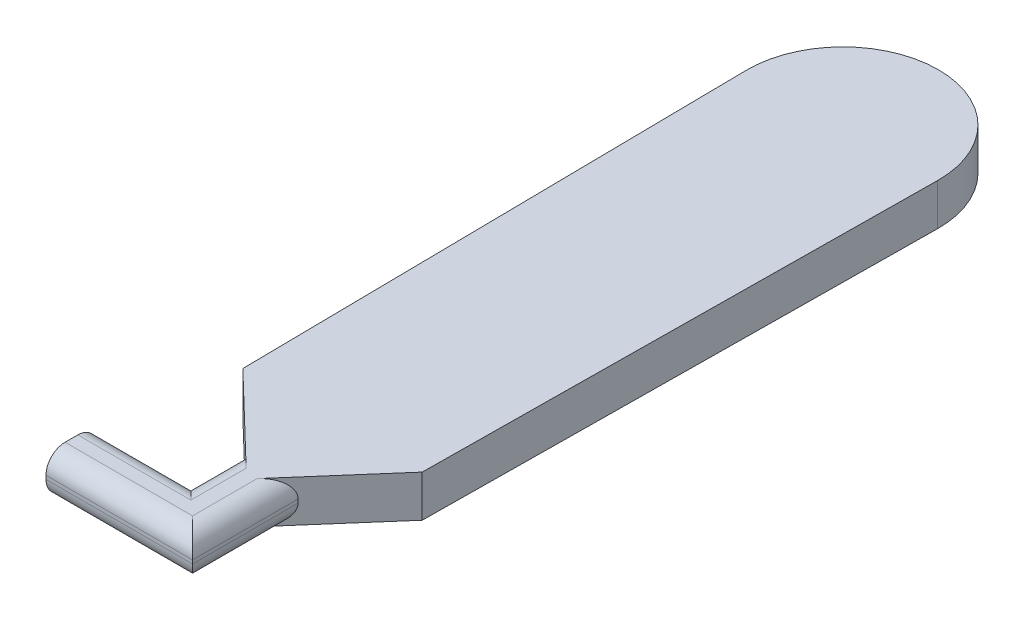
ISO-10303-21;
HEADER;
FILE_DESCRIPTION(('STEP AP214'),'2;1');
FILE_NAME('part.step','',(''),(''),'','','');
FILE_SCHEMA(('AUTOMOTIVE_DESIGN { 1 0 10303 214 1 1 1 1 }'));
ENDSEC;
DATA;
#1=APPLICATION_CONTEXT('core data for automotive mechanical design processes');
#2=APPLICATION_PROTOCOL_DEFINITION('international standard','automotive_design',2000,#1);
#3=PRODUCT_CONTEXT('',#1,'mechanical');
#4=PRODUCT('Part','Part','',(#3));
#5=PRODUCT_RELATED_PRODUCT_CATEGORY('part','',(#4));
#6=PRODUCT_DEFINITION_FORMATION('','',#4);
#7=PRODUCT_DEFINITION_CONTEXT('part definition',#1,'design');
#8=PRODUCT_DEFINITION('design','',#6,#7);
#9=PRODUCT_DEFINITION_SHAPE('','',#8);
#10=(LENGTH_UNIT() NAMED_UNIT(*) SI_UNIT(.MILLI.,.METRE.));
#11=(NAMED_UNIT(*) PLANE_ANGLE_UNIT() SI_UNIT($,.RADIAN.));
#12=(NAMED_UNIT(*) SI_UNIT($,.STERADIAN.) SOLID_ANGLE_UNIT());
#13=UNCERTAINTY_MEASURE_WITH_UNIT(LENGTH_MEASURE(1.E-05),#10,'distance_accuracy_value','');
#14=(GEOMETRIC_REPRESENTATION_CONTEXT(3) GLOBAL_UNCERTAINTY_ASSIGNED_CONTEXT((#13)) GLOBAL_UNIT_ASSIGNED_CONTEXT((#10,
#11,#12)) REPRESENTATION_CONTEXT('',''));
#15=CARTESIAN_POINT('',(0.,0.,0.));
#16=DIRECTION('',(0.,0.,1.));
#17=DIRECTION('',(1.,0.,0.));
#18=AXIS2_PLACEMENT_3D('',#15,#16,#17);
#19=CARTESIAN_POINT('',(8.67320172340913,10.,-0.111731628823776));
#20=DIRECTION('',(-0.999917032248953,0.,0.0128813282873694));
#21=DIRECTION('',(0.0128813282873694,0.,0.999917032248953));
#22=AXIS2_PLACEMENT_3D('',#19,#20,#21);
#23=PLANE('',#22);
#24=DIRECTION('',(-0.0128813282873694,0.,-0.999917032248953));
#25=VECTOR('',#24,1.);
#26=CARTESIAN_POINT('',(8.67320172340913,0.,-0.111731628823776));
#27=LINE('',#26,#25);
#28=CARTESIAN_POINT('',(7.67302590939626,0.,-77.7506838675886));
#29=VERTEX_POINT('',#28);
#30=CARTESIAN_POINT('',(6.09883614107377,0.,-199.947644167181));
#31=VERTEX_POINT('',#30);
#32=EDGE_CURVE('E159',#29,#31,#27,.T.);
#33=ORIENTED_EDGE('',*,*,#32,.F.);
#34=DIRECTION('',(0.,-1.,0.));
#35=VECTOR('',#34,1.);
#36=CARTESIAN_POINT('',(7.67302590939626,10.,-77.7506838675886));
#37=LINE('',#36,#35);
#38=CARTESIAN_POINT('',(7.67302590939626,10.,-77.7506838675886));
#39=VERTEX_POINT('',#38);
#40=EDGE_CURVE('E154',#39,#29,#37,.T.);
#41=ORIENTED_EDGE('',*,*,#40,.F.);
#42=DIRECTION('',(-0.0128813282873694,0.,-0.999917032248953));
#43=VECTOR('',#42,1.);
#44=CARTESIAN_POINT('',(8.67320172340913,10.,-0.111731628823776));
#45=LINE('',#44,#43);
#46=CARTESIAN_POINT('',(6.09883614107377,10.,-199.947644167181));
#47=VERTEX_POINT('',#46);
#48=EDGE_CURVE('E157',#39,#47,#45,.T.);
#49=ORIENTED_EDGE('',*,*,#48,.T.);
#50=DIRECTION('',(0.,-1.,0.));
#51=VECTOR('',#50,1.);
#52=CARTESIAN_POINT('',(6.09883614107377,10.,-199.947644167181));
#53=LINE('',#52,#51);
#54=EDGE_CURVE('E191',#47,#31,#53,.T.);
#55=ORIENTED_EDGE('',*,*,#54,.T.);
#56=EDGE_LOOP('',(#33,#41,#49,#55));
#57=FACE_BOUND('',#56,.T.);
#58=ADVANCED_FACE('F39',(#57),#23,.T.);
#59=CARTESIAN_POINT('',(42.5354193090019,10.,-44.2050407153228));
#60=DIRECTION('',(0.693367619628063,0.,-0.720584029833658));
#61=DIRECTION('',(-0.720584029833658,0.,-0.693367619628063));
#62=AXIS2_PLACEMENT_3D('',#59,#60,#61);
#63=PLANE('',#62);
#64=DIRECTION('',(0.720584029833658,0.,0.693367619628063));
#65=VECTOR('',#64,1.);
#66=CARTESIAN_POINT('',(42.5354193090019,0.,-44.2050407153228));
#67=LINE('',#66,#65);
#68=CARTESIAN_POINT('',(28.76441124198,0.,-57.4559187364662));
#69=VERTEX_POINT('',#68);
#70=EDGE_CURVE('E193',#29,#69,#67,.T.);
#71=ORIENTED_EDGE('',*,*,#70,.T.);
#72=CARTESIAN_POINT('',(28.76441124198,4.572,-57.4559187364662));
#73=DIRECTION('',(0.693367619628063,0.,-0.720584029833658));
#74=DIRECTION('',(0.720584029833658,0.,0.693367619628063));
#75=AXIS2_PLACEMENT_3D('',#72,#73,#74);
#76=ELLIPSE('',#75,6.34485335604151,4.572);
#77=CARTESIAN_POINT('',(24.19241124198,4.572,-61.8552346048338));
#78=VERTEX_POINT('',#77);
#79=EDGE_CURVE('E48',#69,#78,#76,.T.);
#80=ORIENTED_EDGE('',*,*,#79,.T.);
#81=DIRECTION('',(0.,-1.,0.));
#82=VECTOR('',#81,1.);
#83=CARTESIAN_POINT('',(24.19241124198,10.,-61.8552346048338));
#84=LINE('',#83,#82);
#85=CARTESIAN_POINT('',(24.19241124198,5.428,-61.8552346048338));
#86=VERTEX_POINT('',#85);
#87=EDGE_CURVE('E162',#86,#78,#84,.T.);
#88=ORIENTED_EDGE('',*,*,#87,.F.);
#89=CARTESIAN_POINT('',(28.76441124198,5.428,-57.4559187364662));
#90=DIRECTION('',(0.693367619628063,0.,-0.720584029833658));
#91=DIRECTION('',(-0.720584029833658,0.,-0.693367619628063));
#92=AXIS2_PLACEMENT_3D('',#89,#90,#91);
#93=ELLIPSE('',#92,6.34485335604151,4.572);
#94=CARTESIAN_POINT('',(28.76441124198,10.,-57.4559187364662));
#95=VERTEX_POINT('',#94);
#96=EDGE_CURVE('E11',#86,#95,#93,.T.);
#97=ORIENTED_EDGE('',*,*,#96,.T.);
#98=DIRECTION('',(0.720584029833658,0.,0.693367619628063));
#99=VECTOR('',#98,1.);
#100=CARTESIAN_POINT('',(42.5354193090019,10.,-44.2050407153228));
#101=LINE('',#100,#99);
#102=EDGE_CURVE('E164',#39,#95,#101,.T.);
#103=ORIENTED_EDGE('',*,*,#102,.F.);
#104=ORIENTED_EDGE('',*,*,#40,.T.);
#105=EDGE_LOOP('',(#71,#80,#88,#97,#103,#104));
#106=FACE_BOUND('',#105,.T.);
#107=ADVANCED_FACE('F165',(#106),#63,.F.);
#108=CARTESIAN_POINT('',(24.19241124198,10.,0.));
#109=DIRECTION('',(1.,0.,0.));
#110=DIRECTION('',(0.,0.,-1.));
#111=AXIS2_PLACEMENT_3D('',#108,#109,#110);
#112=PLANE('',#111);
#113=ORIENTED_EDGE('',*,*,#87,.T.);
#114=DIRECTION('',(0.,0.,1.));
#115=VECTOR('',#114,1.);
#116=CARTESIAN_POINT('',(24.19241124198,4.572,0.));
#117=LINE('',#116,#115);
#118=CARTESIAN_POINT('',(24.19241124198,4.572,-48.7662679513612));
#119=VERTEX_POINT('',#118);
#120=EDGE_CURVE('E261',#78,#119,#117,.T.);
#121=ORIENTED_EDGE('',*,*,#120,.T.);
#122=DIRECTION('',(0.,-1.,0.));
#123=VECTOR('',#122,1.);
#124=CARTESIAN_POINT('',(24.19241124198,10.,-48.7662679513612));
#125=LINE('',#124,#123);
#126=CARTESIAN_POINT('',(24.19241124198,5.428,-48.7662679513612));
#127=VERTEX_POINT('',#126);
#128=EDGE_CURVE('E221',#127,#119,#125,.T.);
#129=ORIENTED_EDGE('',*,*,#128,.F.);
#130=DIRECTION('',(0.,0.,1.));
#131=VECTOR('',#130,1.);
#132=CARTESIAN_POINT('',(24.19241124198,5.428,-61.8552346048338));
#133=LINE('',#132,#131);
#134=EDGE_CURVE('E62',#127,#86,#133,.F.);
#135=ORIENTED_EDGE('',*,*,#134,.T.);
#136=EDGE_LOOP('',(#113,#121,#129,#135));
#137=FACE_BOUND('',#136,.T.);
#138=ADVANCED_FACE('F333',(#137),#112,.F.);
#139=CARTESIAN_POINT('',(0.,10.,-48.7662679513612));
#140=DIRECTION('',(0.,0.,1.));
#141=DIRECTION('',(1.,0.,0.));
#142=AXIS2_PLACEMENT_3D('',#139,#140,#141);
#143=PLANE('',#142);
#144=ORIENTED_EDGE('',*,*,#128,.T.);
#145=DIRECTION('',(-1.,0.,0.));
#146=VECTOR('',#145,1.);
#147=CARTESIAN_POINT('',(0.,4.572,-48.7662679513612));
#148=LINE('',#147,#146);
#149=CARTESIAN_POINT('',(1.67291809905842,4.572,-48.7662679513612));
#150=VERTEX_POINT('',#149);
#151=EDGE_CURVE('E266',#119,#150,#148,.T.);
#152=ORIENTED_EDGE('',*,*,#151,.T.);
#153=DIRECTION('',(0.,-1.,0.));
#154=VECTOR('',#153,1.);
#155=CARTESIAN_POINT('',(1.67291809905842,10.,-48.7662679513612));
#156=LINE('',#155,#154);
#157=CARTESIAN_POINT('',(1.67291809905842,5.428,-48.7662679513612));
#158=VERTEX_POINT('',#157);
#159=EDGE_CURVE('E218',#158,#150,#156,.T.);
#160=ORIENTED_EDGE('',*,*,#159,.F.);
#161=DIRECTION('',(-1.,0.,0.));
#162=VECTOR('',#161,1.);
#163=CARTESIAN_POINT('',(24.19241124198,5.428,-48.7662679513612));
#164=LINE('',#163,#162);
#165=EDGE_CURVE('E264',#158,#127,#164,.F.);
#166=ORIENTED_EDGE('',*,*,#165,.T.);
#167=EDGE_LOOP('',(#144,#152,#160,#166));
#168=FACE_BOUND('',#167,.T.);
#169=ADVANCED_FACE('F335',(#168),#143,.F.);
#170=CARTESIAN_POINT('',(1.67291809905842,10.,0.));
#171=DIRECTION('',(1.,0.,0.));
#172=DIRECTION('',(0.,0.,-1.));
#173=AXIS2_PLACEMENT_3D('',#170,#171,#172);
#174=PLANE('',#173);
#175=DIRECTION('',(0.,-1.,0.));
#176=VECTOR('',#175,1.);
#177=CARTESIAN_POINT('',(1.67291809905842,10.,-36.5645685473484));
#178=LINE('',#177,#176);
#179=CARTESIAN_POINT('',(1.67291809905842,5.428,-36.5645685473484));
#180=VERTEX_POINT('',#179);
#181=CARTESIAN_POINT('',(1.67291809905842,4.572,-36.5645685473484));
#182=VERTEX_POINT('',#181);
#183=EDGE_CURVE('E215',#180,#182,#178,.T.);
#184=ORIENTED_EDGE('',*,*,#183,.F.);
#185=CARTESIAN_POINT('',(1.67291809905842,5.428,-41.1365685473484));
#186=DIRECTION('',(1.,0.,0.));
#187=DIRECTION('',(0.,0.,-1.));
#188=AXIS2_PLACEMENT_3D('',#185,#186,#187);
#189=CIRCLE('',#188,4.572);
#190=CARTESIAN_POINT('',(1.67291809905842,10.,-41.1365685473484));
#191=VERTEX_POINT('',#190);
#192=EDGE_CURVE('E245',#180,#191,#189,.F.);
#193=ORIENTED_EDGE('',*,*,#192,.T.);
#194=DIRECTION('',(0.,0.,1.));
#195=VECTOR('',#194,1.);
#196=CARTESIAN_POINT('',(1.67291809905842,10.,0.));
#197=LINE('',#196,#195);
#198=CARTESIAN_POINT('',(1.67291809905842,10.,-44.1942679513612));
#199=VERTEX_POINT('',#198);
#200=EDGE_CURVE('E170',#199,#191,#197,.T.);
#201=ORIENTED_EDGE('',*,*,#200,.F.);
#202=CARTESIAN_POINT('',(1.67291809905842,5.428,-44.1942679513612));
#203=DIRECTION('',(1.,0.,0.));
#204=DIRECTION('',(0.,0.,-1.));
#205=AXIS2_PLACEMENT_3D('',#202,#203,#204);
#206=CIRCLE('',#205,4.572);
#207=EDGE_CURVE('E239',#199,#158,#206,.F.);
#208=ORIENTED_EDGE('',*,*,#207,.T.);
#209=ORIENTED_EDGE('',*,*,#159,.T.);
#210=CARTESIAN_POINT('',(1.67291809905842,4.572,-44.1942679513612));
#211=DIRECTION('',(1.,0.,0.));
#212=DIRECTION('',(0.,0.,-1.));
#213=AXIS2_PLACEMENT_3D('',#210,#211,#212);
#214=CIRCLE('',#213,4.572);
#215=CARTESIAN_POINT('',(1.67291809905842,0.,-44.1942679513612));
#216=VERTEX_POINT('',#215);
#217=EDGE_CURVE('E241',#150,#216,#214,.F.);
#218=ORIENTED_EDGE('',*,*,#217,.T.);
#219=DIRECTION('',(0.,0.,1.));
#220=VECTOR('',#219,1.);
#221=CARTESIAN_POINT('',(1.67291809905842,0.,0.));
#222=LINE('',#221,#220);
#223=CARTESIAN_POINT('',(1.67291809905842,0.,-41.1365685473484));
#224=VERTEX_POINT('',#223);
#225=EDGE_CURVE('E196',#216,#224,#222,.T.);
#226=ORIENTED_EDGE('',*,*,#225,.T.);
#227=CARTESIAN_POINT('',(1.67291809905842,4.572,-41.1365685473484));
#228=DIRECTION('',(1.,0.,0.));
#229=DIRECTION('',(0.,0.,-1.));
#230=AXIS2_PLACEMENT_3D('',#227,#228,#229);
#231=CIRCLE('',#230,4.572);
#232=EDGE_CURVE('E243',#224,#182,#231,.F.);
#233=ORIENTED_EDGE('',*,*,#232,.T.);
#234=EDGE_LOOP('',(#184,#193,#201,#208,#209,#218,#226,#233));
#235=FACE_BOUND('',#234,.T.);
#236=ADVANCED_FACE('F293',(#235),#174,.F.);
#237=CARTESIAN_POINT('',(0.,10.,-36.5645685473484));
#238=DIRECTION('',(0.,0.,-1.));
#239=DIRECTION('',(-1.,0.,0.));
#240=AXIS2_PLACEMENT_3D('',#237,#238,#239);
#241=PLANE('',#240);
#242=DIRECTION('',(0.,-1.,0.));
#243=VECTOR('',#242,1.);
#244=CARTESIAN_POINT('',(36.8166245477847,10.,-36.5645685473484));
#245=LINE('',#244,#243);
#246=CARTESIAN_POINT('',(36.8166245477847,5.428,-36.5645685473484));
#247=VERTEX_POINT('',#246);
#248=CARTESIAN_POINT('',(36.8166245477847,4.572,-36.5645685473484));
#249=VERTEX_POINT('',#248);
#250=EDGE_CURVE('E212',#247,#249,#245,.T.);
#251=ORIENTED_EDGE('',*,*,#250,.F.);
#252=DIRECTION('',(1.,0.,0.));
#253=VECTOR('',#252,1.);
#254=CARTESIAN_POINT('',(1.67291809905842,5.428,-36.5645685473484));
#255=LINE('',#254,#253);
#256=EDGE_CURVE('E237',#247,#180,#255,.F.);
#257=ORIENTED_EDGE('',*,*,#256,.T.);
#258=ORIENTED_EDGE('',*,*,#183,.T.);
#259=DIRECTION('',(1.,0.,0.));
#260=VECTOR('',#259,1.);
#261=CARTESIAN_POINT('',(0.,4.572,-36.5645685473484));
#262=LINE('',#261,#260);
#263=EDGE_CURVE('E234',#182,#249,#262,.T.);
#264=ORIENTED_EDGE('',*,*,#263,.T.);
#265=EDGE_LOOP('',(#251,#257,#258,#264));
#266=FACE_BOUND('',#265,.T.);
#267=ADVANCED_FACE('F320',(#266),#241,.F.);
#268=CARTESIAN_POINT('',(36.8166245477847,10.,0.));
#269=DIRECTION('',(-1.,0.,0.));
#270=DIRECTION('',(0.,0.,1.));
#271=AXIS2_PLACEMENT_3D('',#268,#269,#270);
#272=PLANE('',#271);
#273=DIRECTION('',(0.,-1.,0.));
#274=VECTOR('',#273,1.);
#275=CARTESIAN_POINT('',(36.8166245477847,10.,-61.8552346048338));
#276=LINE('',#275,#274);
#277=CARTESIAN_POINT('',(36.8166245477847,5.428,-61.8552346048338));
#278=VERTEX_POINT('',#277);
#279=CARTESIAN_POINT('',(36.8166245477847,4.572,-61.8552346048338));
#280=VERTEX_POINT('',#279);
#281=EDGE_CURVE('E209',#278,#280,#276,.T.);
#282=ORIENTED_EDGE('',*,*,#281,.F.);
#283=DIRECTION('',(0.,0.,-1.));
#284=VECTOR('',#283,1.);
#285=CARTESIAN_POINT('',(36.8166245477847,5.428,-36.5645685473484));
#286=LINE('',#285,#284);
#287=EDGE_CURVE('E258',#278,#247,#286,.F.);
#288=ORIENTED_EDGE('',*,*,#287,.T.);
#289=ORIENTED_EDGE('',*,*,#250,.T.);
#290=DIRECTION('',(0.,0.,-1.));
#291=VECTOR('',#290,1.);
#292=CARTESIAN_POINT('',(36.8166245477847,4.572,0.));
#293=LINE('',#292,#291);
#294=EDGE_CURVE('E256',#249,#280,#293,.T.);
#295=ORIENTED_EDGE('',*,*,#294,.T.);
#296=EDGE_LOOP('',(#282,#288,#289,#295));
#297=FACE_BOUND('',#296,.T.);
#298=ADVANCED_FACE('F311',(#297),#272,.F.);
#299=CARTESIAN_POINT('',(-9.72544141948012,10.,-8.48044875271906));
#300=DIRECTION('',(-0.753701371654878,0.,-0.65721704357507));
#301=DIRECTION('',(-0.65721704357507,0.,0.753701371654878));
#302=AXIS2_PLACEMENT_3D('',#299,#300,#301);
#303=PLANE('',#302);
#304=DIRECTION('',(0.65721704357507,0.,-0.753701371654878));
#305=VECTOR('',#304,1.);
#306=CARTESIAN_POINT('',(-9.72544141948012,0.,-8.48044875271906));
#307=LINE('',#306,#305);
#308=CARTESIAN_POINT('',(32.2446245477847,0.,-56.6120311534119));
#309=VERTEX_POINT('',#308);
#310=CARTESIAN_POINT('',(50.677233754091,0.,-77.7506838675886));
#311=VERTEX_POINT('',#310);
#312=EDGE_CURVE('E199',#309,#311,#307,.T.);
#313=ORIENTED_EDGE('',*,*,#312,.T.);
#314=DIRECTION('',(0.,-1.,0.));
#315=VECTOR('',#314,1.);
#316=CARTESIAN_POINT('',(50.677233754091,10.,-77.7506838675886));
#317=LINE('',#316,#315);
#318=CARTESIAN_POINT('',(50.677233754091,10.,-77.7506838675886));
#319=VERTEX_POINT('',#318);
#320=EDGE_CURVE('E207',#319,#311,#317,.T.);
#321=ORIENTED_EDGE('',*,*,#320,.F.);
#322=DIRECTION('',(0.65721704357507,0.,-0.753701371654878));
#323=VECTOR('',#322,1.);
#324=CARTESIAN_POINT('',(-9.72544141948012,10.,-8.48044875271906));
#325=LINE('',#324,#323);
#326=CARTESIAN_POINT('',(32.2446245477847,10.,-56.6120311534119));
#327=VERTEX_POINT('',#326);
#328=EDGE_CURVE('E185',#327,#319,#325,.T.);
#329=ORIENTED_EDGE('',*,*,#328,.F.);
#330=CARTESIAN_POINT('',(32.2446245477847,5.428,-56.6120311534119));
#331=DIRECTION('',(-0.753701371654878,0.,-0.65721704357507));
#332=DIRECTION('',(-0.65721704357507,0.,0.753701371654878));
#333=AXIS2_PLACEMENT_3D('',#330,#331,#332);
#334=ELLIPSE('',#333,6.9566059564275,4.572);
#335=EDGE_CURVE('E268',#327,#278,#334,.T.);
#336=ORIENTED_EDGE('',*,*,#335,.T.);
#337=ORIENTED_EDGE('',*,*,#281,.T.);
#338=CARTESIAN_POINT('',(32.2446245477847,4.572,-56.6120311534119));
#339=DIRECTION('',(-0.753701371654878,0.,-0.65721704357507));
#340=DIRECTION('',(0.65721704357507,0.,-0.753701371654878));
#341=AXIS2_PLACEMENT_3D('',#338,#339,#340);
#342=ELLIPSE('',#341,6.9566059564275,4.572);
#343=EDGE_CURVE('E270',#280,#309,#342,.T.);
#344=ORIENTED_EDGE('',*,*,#343,.T.);
#345=EDGE_LOOP('',(#313,#321,#329,#336,#337,#344));
#346=FACE_BOUND('',#345,.T.);
#347=ADVANCED_FACE('F308',(#346),#303,.F.);
#348=CARTESIAN_POINT('',(49.8783176600329,10.,0.509182961049452));
#349=DIRECTION('',(0.999947897304426,0.,0.0102079712213835));
#350=DIRECTION('',(0.0102079712213835,0.,-0.999947897304426));
#351=AXIS2_PLACEMENT_3D('',#348,#349,#350);
#352=PLANE('',#351);
#353=DIRECTION('',(-0.0102079712213835,0.,0.999947897304426));
#354=VECTOR('',#353,1.);
#355=CARTESIAN_POINT('',(49.8783176600329,0.,0.509182961049452));
#356=LINE('',#355,#354);
#357=CARTESIAN_POINT('',(51.925307170323,0.,-200.008903564416));
#358=VERTEX_POINT('',#357);
#359=EDGE_CURVE('E181',#358,#311,#356,.T.);
#360=ORIENTED_EDGE('',*,*,#359,.F.);
#361=DIRECTION('',(0.,-1.,0.));
#362=VECTOR('',#361,1.);
#363=CARTESIAN_POINT('',(51.925307170323,10.,-200.008903564416));
#364=LINE('',#363,#362);
#365=CARTESIAN_POINT('',(51.925307170323,10.,-200.008903564416));
#366=VERTEX_POINT('',#365);
#367=EDGE_CURVE('E205',#366,#358,#364,.T.);
#368=ORIENTED_EDGE('',*,*,#367,.F.);
#369=DIRECTION('',(-0.0102079712213835,0.,0.999947897304426));
#370=VECTOR('',#369,1.);
#371=CARTESIAN_POINT('',(49.8783176600329,10.,0.509182961049452));
#372=LINE('',#371,#370);
#373=EDGE_CURVE('E187',#366,#319,#372,.T.);
#374=ORIENTED_EDGE('',*,*,#373,.T.);
#375=ORIENTED_EDGE('',*,*,#320,.T.);
#376=EDGE_LOOP('',(#360,#368,#374,#375));
#377=FACE_BOUND('',#376,.T.);
#378=ADVANCED_FACE('F412',(#377),#352,.T.);
#379=CARTESIAN_POINT('',(29.0117180226731,10.,-200.242817010535));
#380=DIRECTION('',(0.,-1.,0.));
#381=DIRECTION('',(0.,0.,-1.));
#382=AXIS2_PLACEMENT_3D('',#379,#380,#381);
#383=CYLINDRICAL_SURFACE('',#382,22.9147830696163);
#384=CARTESIAN_POINT('',(29.0117180226731,0.,-200.242817010535));
#385=DIRECTION('',(0.,1.,0.));
#386=DIRECTION('',(0.,0.,1.));
#387=AXIS2_PLACEMENT_3D('',#384,#385,#386);
#388=CIRCLE('',#387,22.9147830696163);
#389=EDGE_CURVE('E178',#358,#31,#388,.T.);
#390=ORIENTED_EDGE('',*,*,#389,.T.);
#391=ORIENTED_EDGE('',*,*,#54,.F.);
#392=CARTESIAN_POINT('',(29.0117180226731,10.,-200.242817010535));
#393=DIRECTION('',(0.,1.,0.));
#394=DIRECTION('',(0.,0.,1.));
#395=AXIS2_PLACEMENT_3D('',#392,#393,#394);
#396=CIRCLE('',#395,22.9147830696163);
#397=EDGE_CURVE('E176',#366,#47,#396,.T.);
#398=ORIENTED_EDGE('',*,*,#397,.F.);
#399=ORIENTED_EDGE('',*,*,#367,.T.);
#400=EDGE_LOOP('',(#390,#391,#398,#399));
#401=FACE_BOUND('',#400,.T.);
#402=ADVANCED_FACE('F404',(#401),#383,.T.);
#403=CARTESIAN_POINT('',(0.,10.,0.));
#404=DIRECTION('',(0.,1.,0.));
#405=DIRECTION('',(0.,0.,1.));
#406=AXIS2_PLACEMENT_3D('',#403,#404,#405);
#407=PLANE('',#406);
#408=ORIENTED_EDGE('',*,*,#200,.T.);
#409=DIRECTION('',(1.,0.,0.));
#410=VECTOR('',#409,1.);
#411=CARTESIAN_POINT('',(36.8166245477847,10.,-41.1365685473484));
#412=LINE('',#411,#410);
#413=CARTESIAN_POINT('',(32.2446245477847,10.,-41.1365685473484));
#414=VERTEX_POINT('',#413);
#415=EDGE_CURVE('E231',#191,#414,#412,.T.);
#416=ORIENTED_EDGE('',*,*,#415,.T.);
#417=DIRECTION('',(0.,0.,-1.));
#418=VECTOR('',#417,1.);
#419=CARTESIAN_POINT('',(32.2446245477847,10.,-61.8552346048338));
#420=LINE('',#419,#418);
#421=EDGE_CURVE('E228',#414,#327,#420,.T.);
#422=ORIENTED_EDGE('',*,*,#421,.T.);
#423=ORIENTED_EDGE('',*,*,#328,.T.);
#424=ORIENTED_EDGE('',*,*,#373,.F.);
#425=ORIENTED_EDGE('',*,*,#397,.T.);
#426=ORIENTED_EDGE('',*,*,#48,.F.);
#427=ORIENTED_EDGE('',*,*,#102,.T.);
#428=DIRECTION('',(0.,0.,1.));
#429=VECTOR('',#428,1.);
#430=CARTESIAN_POINT('',(28.76441124198,10.,-48.7662679513612));
#431=LINE('',#430,#429);
#432=CARTESIAN_POINT('',(28.76441124198,10.,-44.1942679513612));
#433=VERTEX_POINT('',#432);
#434=EDGE_CURVE('E226',#95,#433,#431,.T.);
#435=ORIENTED_EDGE('',*,*,#434,.T.);
#436=DIRECTION('',(-1.,0.,0.));
#437=VECTOR('',#436,1.);
#438=CARTESIAN_POINT('',(1.67291809905842,10.,-44.1942679513612));
#439=LINE('',#438,#437);
#440=EDGE_CURVE('E161',#433,#199,#439,.T.);
#441=ORIENTED_EDGE('',*,*,#440,.T.);
#442=EDGE_LOOP('',(#408,#416,#422,#423,#424,#425,#426,#427,#435,#441));
#443=FACE_BOUND('',#442,.T.);
#444=ADVANCED_FACE('F173',(#443),#407,.T.);
#445=CARTESIAN_POINT('',(0.,0.,0.));
#446=DIRECTION('',(0.,1.,0.));
#447=DIRECTION('',(0.,0.,1.));
#448=AXIS2_PLACEMENT_3D('',#445,#446,#447);
#449=PLANE('',#448);
#450=DIRECTION('',(0.,0.,-1.));
#451=VECTOR('',#450,1.);
#452=CARTESIAN_POINT('',(32.2446245477847,0.,0.));
#453=LINE('',#452,#451);
#454=CARTESIAN_POINT('',(32.2446245477847,0.,-41.1365685473484));
#455=VERTEX_POINT('',#454);
#456=EDGE_CURVE('E252',#309,#455,#453,.F.);
#457=ORIENTED_EDGE('',*,*,#456,.T.);
#458=DIRECTION('',(1.,0.,0.));
#459=VECTOR('',#458,1.);
#460=CARTESIAN_POINT('',(0.,0.,-41.1365685473484));
#461=LINE('',#460,#459);
#462=EDGE_CURVE('E254',#455,#224,#461,.F.);
#463=ORIENTED_EDGE('',*,*,#462,.T.);
#464=ORIENTED_EDGE('',*,*,#225,.F.);
#465=DIRECTION('',(-1.,0.,0.));
#466=VECTOR('',#465,1.);
#467=CARTESIAN_POINT('',(0.,0.,-44.1942679513612));
#468=LINE('',#467,#466);
#469=CARTESIAN_POINT('',(28.76441124198,0.,-44.1942679513612));
#470=VERTEX_POINT('',#469);
#471=EDGE_CURVE('E247',#216,#470,#468,.F.);
#472=ORIENTED_EDGE('',*,*,#471,.T.);
#473=DIRECTION('',(0.,0.,1.));
#474=VECTOR('',#473,1.);
#475=CARTESIAN_POINT('',(28.76441124198,0.,0.));
#476=LINE('',#475,#474);
#477=EDGE_CURVE('E249',#470,#69,#476,.F.);
#478=ORIENTED_EDGE('',*,*,#477,.T.);
#479=ORIENTED_EDGE('',*,*,#70,.F.);
#480=ORIENTED_EDGE('',*,*,#32,.T.);
#481=ORIENTED_EDGE('',*,*,#389,.F.);
#482=ORIENTED_EDGE('',*,*,#359,.T.);
#483=ORIENTED_EDGE('',*,*,#312,.F.);
#484=EDGE_LOOP('',(#457,#463,#464,#472,#478,#479,#480,#481,#482,#483));
#485=FACE_BOUND('',#484,.T.);
#486=ADVANCED_FACE('F327',(#485),#449,.F.);
#487=CARTESIAN_POINT('',(32.2446245477847,5.428,0.));
#488=DIRECTION('',(0.,0.,1.));
#489=DIRECTION('',(1.,0.,0.));
#490=AXIS2_PLACEMENT_3D('',#487,#488,#489);
#491=CYLINDRICAL_SURFACE('',#490,4.572);
#492=ORIENTED_EDGE('',*,*,#335,.F.);
#493=ORIENTED_EDGE('',*,*,#421,.F.);
#494=CARTESIAN_POINT('',(32.2446245477847,5.428,-41.1365685473484));
#495=DIRECTION('',(-0.707106781186547,0.,0.707106781186547));
#496=DIRECTION('',(0.707106781186547,0.,0.707106781186547));
#497=AXIS2_PLACEMENT_3D('',#494,#495,#496);
#498=ELLIPSE('',#497,6.46578440716979,4.572);
#499=EDGE_CURVE('E194',#247,#414,#498,.T.);
#500=ORIENTED_EDGE('',*,*,#499,.F.);
#501=ORIENTED_EDGE('',*,*,#287,.F.);
#502=EDGE_LOOP('',(#492,#493,#500,#501));
#503=FACE_BOUND('',#502,.T.);
#504=ADVANCED_FACE('F305',(#503),#491,.T.);
#505=CARTESIAN_POINT('',(0.,5.428,-41.1365685473484));
#506=DIRECTION('',(-1.,0.,0.));
#507=DIRECTION('',(0.,0.,1.));
#508=AXIS2_PLACEMENT_3D('',#505,#506,#507);
#509=CYLINDRICAL_SURFACE('',#508,4.572);
#510=ORIENTED_EDGE('',*,*,#192,.F.);
#511=ORIENTED_EDGE('',*,*,#256,.F.);
#512=ORIENTED_EDGE('',*,*,#499,.T.);
#513=ORIENTED_EDGE('',*,*,#415,.F.);
#514=EDGE_LOOP('',(#510,#511,#512,#513));
#515=FACE_BOUND('',#514,.T.);
#516=ADVANCED_FACE('F298',(#515),#509,.T.);
#517=CARTESIAN_POINT('',(32.2446245477847,4.572,0.));
#518=DIRECTION('',(0.,0.,-1.));
#519=DIRECTION('',(-1.,0.,0.));
#520=AXIS2_PLACEMENT_3D('',#517,#518,#519);
#521=CYLINDRICAL_SURFACE('',#520,4.572);
#522=ORIENTED_EDGE('',*,*,#343,.F.);
#523=ORIENTED_EDGE('',*,*,#294,.F.);
#524=CARTESIAN_POINT('',(32.2446245477847,4.572,-41.1365685473484));
#525=DIRECTION('',(0.707106781186547,0.,-0.707106781186547));
#526=DIRECTION('',(-0.707106781186547,0.,-0.707106781186547));
#527=AXIS2_PLACEMENT_3D('',#524,#525,#526);
#528=ELLIPSE('',#527,6.46578440716979,4.572);
#529=EDGE_CURVE('E275',#455,#249,#528,.F.);
#530=ORIENTED_EDGE('',*,*,#529,.F.);
#531=ORIENTED_EDGE('',*,*,#456,.F.);
#532=EDGE_LOOP('',(#522,#523,#530,#531));
#533=FACE_BOUND('',#532,.T.);
#534=ADVANCED_FACE('F316',(#533),#521,.T.);
#535=CARTESIAN_POINT('',(0.,4.572,-41.1365685473484));
#536=DIRECTION('',(1.,0.,0.));
#537=DIRECTION('',(0.,0.,-1.));
#538=AXIS2_PLACEMENT_3D('',#535,#536,#537);
#539=CYLINDRICAL_SURFACE('',#538,4.572);
#540=ORIENTED_EDGE('',*,*,#232,.F.);
#541=ORIENTED_EDGE('',*,*,#462,.F.);
#542=ORIENTED_EDGE('',*,*,#529,.T.);
#543=ORIENTED_EDGE('',*,*,#263,.F.);
#544=EDGE_LOOP('',(#540,#541,#542,#543));
#545=FACE_BOUND('',#544,.T.);
#546=ADVANCED_FACE('F323',(#545),#539,.T.);
#547=CARTESIAN_POINT('',(0.,4.572,-44.1942679513612));
#548=DIRECTION('',(-1.,0.,0.));
#549=DIRECTION('',(0.,0.,1.));
#550=AXIS2_PLACEMENT_3D('',#547,#548,#549);
#551=CYLINDRICAL_SURFACE('',#550,4.572);
#552=ORIENTED_EDGE('',*,*,#217,.F.);
#553=ORIENTED_EDGE('',*,*,#151,.F.);
#554=CARTESIAN_POINT('',(28.76441124198,4.572,-44.1942679513612));
#555=DIRECTION('',(-0.707106781186547,0.,0.707106781186547));
#556=DIRECTION('',(0.707106781186547,0.,0.707106781186547));
#557=AXIS2_PLACEMENT_3D('',#554,#555,#556);
#558=ELLIPSE('',#557,6.46578440716979,4.572);
#559=EDGE_CURVE('E276',#470,#119,#558,.F.);
#560=ORIENTED_EDGE('',*,*,#559,.F.);
#561=ORIENTED_EDGE('',*,*,#471,.F.);
#562=EDGE_LOOP('',(#552,#553,#560,#561));
#563=FACE_BOUND('',#562,.T.);
#564=ADVANCED_FACE('F331',(#563),#551,.T.);
#565=CARTESIAN_POINT('',(28.76441124198,4.572,0.));
#566=DIRECTION('',(0.,0.,1.));
#567=DIRECTION('',(1.,0.,0.));
#568=AXIS2_PLACEMENT_3D('',#565,#566,#567);
#569=CYLINDRICAL_SURFACE('',#568,4.572);
#570=ORIENTED_EDGE('',*,*,#79,.F.);
#571=ORIENTED_EDGE('',*,*,#477,.F.);
#572=ORIENTED_EDGE('',*,*,#559,.T.);
#573=ORIENTED_EDGE('',*,*,#120,.F.);
#574=EDGE_LOOP('',(#570,#571,#572,#573));
#575=FACE_BOUND('',#574,.T.);
#576=ADVANCED_FACE('F332',(#575),#569,.T.);
#577=CARTESIAN_POINT('',(0.,5.428,-44.1942679513612));
#578=DIRECTION('',(1.,0.,0.));
#579=DIRECTION('',(0.,0.,-1.));
#580=AXIS2_PLACEMENT_3D('',#577,#578,#579);
#581=CYLINDRICAL_SURFACE('',#580,4.572);
#582=ORIENTED_EDGE('',*,*,#207,.F.);
#583=ORIENTED_EDGE('',*,*,#440,.F.);
#584=CARTESIAN_POINT('',(28.76441124198,5.428,-44.1942679513612));
#585=DIRECTION('',(0.707106781186547,0.,-0.707106781186547));
#586=DIRECTION('',(-0.707106781186547,0.,-0.707106781186547));
#587=AXIS2_PLACEMENT_3D('',#584,#585,#586);
#588=ELLIPSE('',#587,6.46578440716979,4.572);
#589=EDGE_CURVE('E43',#127,#433,#588,.T.);
#590=ORIENTED_EDGE('',*,*,#589,.F.);
#591=ORIENTED_EDGE('',*,*,#165,.F.);
#592=EDGE_LOOP('',(#582,#583,#590,#591));
#593=FACE_BOUND('',#592,.T.);
#594=ADVANCED_FACE('F41',(#593),#581,.T.);
#595=CARTESIAN_POINT('',(28.76441124198,5.428,0.));
#596=DIRECTION('',(0.,0.,-1.));
#597=DIRECTION('',(-1.,0.,0.));
#598=AXIS2_PLACEMENT_3D('',#595,#596,#597);
#599=CYLINDRICAL_SURFACE('',#598,4.572);
#600=ORIENTED_EDGE('',*,*,#96,.F.);
#601=ORIENTED_EDGE('',*,*,#134,.F.);
#602=ORIENTED_EDGE('',*,*,#589,.T.);
#603=ORIENTED_EDGE('',*,*,#434,.F.);
#604=EDGE_LOOP('',(#600,#601,#602,#603));
#605=FACE_BOUND('',#604,.T.);
#606=ADVANCED_FACE('F285',(#605),#599,.T.);
#607=CLOSED_SHELL('',(#58,#107,#138,#169,#236,#267,#298,#347,#378,#402,#444,#486,#504,#516,#534,
#546,#564,#576,#594,#606));
#608=MANIFOLD_SOLID_BREP('B2',#607);
#609=ADVANCED_BREP_SHAPE_REPRESENTATION('',(#18,#608),#14);
#610=SHAPE_DEFINITION_REPRESENTATION(#9,#609);
ENDSEC;
END-ISO-10303-21;
